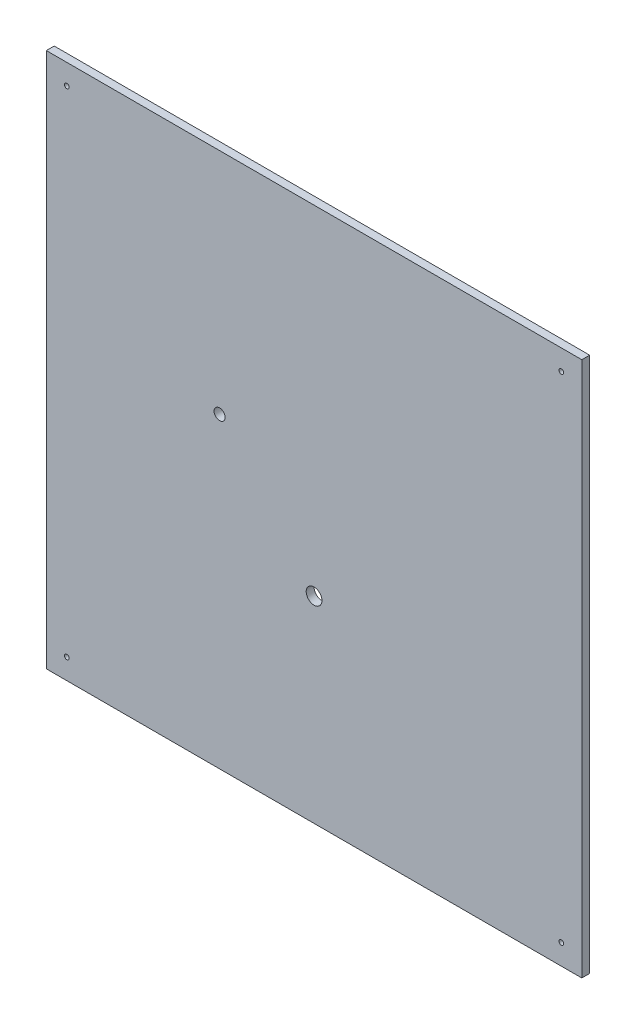
ISO-10303-21;
HEADER;
FILE_DESCRIPTION(('STEP AP214'),'2;1');
FILE_NAME('part.step','',(''),(''),'','','');
FILE_SCHEMA(('AUTOMOTIVE_DESIGN { 1 0 10303 214 1 1 1 1 }'));
ENDSEC;
DATA;
#1=APPLICATION_CONTEXT('core data for automotive mechanical design processes');
#2=APPLICATION_PROTOCOL_DEFINITION('international standard','automotive_design',2000,#1);
#3=PRODUCT_CONTEXT('',#1,'mechanical');
#4=PRODUCT('Part','Part','',(#3));
#5=PRODUCT_RELATED_PRODUCT_CATEGORY('part','',(#4));
#6=PRODUCT_DEFINITION_FORMATION('','',#4);
#7=PRODUCT_DEFINITION_CONTEXT('part definition',#1,'design');
#8=PRODUCT_DEFINITION('design','',#6,#7);
#9=PRODUCT_DEFINITION_SHAPE('','',#8);
#10=(LENGTH_UNIT() NAMED_UNIT(*) SI_UNIT(.MILLI.,.METRE.));
#11=(NAMED_UNIT(*) PLANE_ANGLE_UNIT() SI_UNIT($,.RADIAN.));
#12=(NAMED_UNIT(*) SI_UNIT($,.STERADIAN.) SOLID_ANGLE_UNIT());
#13=UNCERTAINTY_MEASURE_WITH_UNIT(LENGTH_MEASURE(1.E-05),#10,'distance_accuracy_value','');
#14=(GEOMETRIC_REPRESENTATION_CONTEXT(3) GLOBAL_UNCERTAINTY_ASSIGNED_CONTEXT((#13)) GLOBAL_UNIT_ASSIGNED_CONTEXT((#10,
#11,#12)) REPRESENTATION_CONTEXT('',''));
#15=CARTESIAN_POINT('',(0.,0.,0.));
#16=DIRECTION('',(0.,0.,1.));
#17=DIRECTION('',(1.,0.,0.));
#18=AXIS2_PLACEMENT_3D('',#15,#16,#17);
#19=CARTESIAN_POINT('',(0.,0.,5.));
#20=DIRECTION('',(0.,0.,1.));
#21=DIRECTION('',(1.,0.,0.));
#22=AXIS2_PLACEMENT_3D('',#19,#20,#21);
#23=PLANE('',#22);
#24=CARTESIAN_POINT('',(108.94719541036,-165.463974457952,5.));
#25=DIRECTION('',(0.,0.,1.));
#26=DIRECTION('',(1.,0.,0.));
#27=AXIS2_PLACEMENT_3D('',#24,#25,#26);
#28=CIRCLE('',#27,5.00000000000001);
#29=CARTESIAN_POINT('',(113.94719541036,-165.463974457952,5.));
#30=VERTEX_POINT('',#29);
#31=EDGE_CURVE('E133',#30,#30,#28,.T.);
#32=ORIENTED_EDGE('',*,*,#31,.F.);
#33=EDGE_LOOP('',(#32));
#34=FACE_BOUND('',#33,.T.);
#35=CARTESIAN_POINT('',(265.94719541036,-277.463974457952,5.));
#36=DIRECTION('',(0.,0.,1.));
#37=DIRECTION('',(1.,0.,0.));
#38=AXIS2_PLACEMENT_3D('',#35,#36,#37);
#39=CIRCLE('',#38,1.50000000000002);
#40=CARTESIAN_POINT('',(267.44719541036,-277.463974457952,5.));
#41=VERTEX_POINT('',#40);
#42=EDGE_CURVE('E121',#41,#41,#39,.T.);
#43=ORIENTED_EDGE('',*,*,#42,.F.);
#44=EDGE_LOOP('',(#43));
#45=FACE_BOUND('',#44,.T.);
#46=CARTESIAN_POINT('',(-48.0528045896396,-277.463974457952,5.));
#47=DIRECTION('',(0.,0.,1.));
#48=DIRECTION('',(1.,0.,0.));
#49=AXIS2_PLACEMENT_3D('',#46,#47,#48);
#50=CIRCLE('',#49,1.5);
#51=CARTESIAN_POINT('',(-46.5528045896396,-277.463974457952,5.));
#52=VERTEX_POINT('',#51);
#53=EDGE_CURVE('E100',#52,#52,#50,.T.);
#54=ORIENTED_EDGE('',*,*,#53,.F.);
#55=EDGE_LOOP('',(#54));
#56=FACE_BOUND('',#55,.T.);
#57=DIRECTION('',(0.,-1.,0.));
#58=VECTOR('',#57,1.);
#59=CARTESIAN_POINT('',(-61.0528045896396,49.5360255420485,5.));
#60=LINE('',#59,#58);
#61=CARTESIAN_POINT('',(-61.0528045896396,49.5360255420485,5.));
#62=VERTEX_POINT('',#61);
#63=CARTESIAN_POINT('',(-61.0528045896396,-290.463974457952,5.));
#64=VERTEX_POINT('',#63);
#65=EDGE_CURVE('E85',#62,#64,#60,.T.);
#66=ORIENTED_EDGE('',*,*,#65,.T.);
#67=DIRECTION('',(1.,0.,0.));
#68=VECTOR('',#67,1.);
#69=CARTESIAN_POINT('',(-61.0528045896396,-290.463974457952,5.));
#70=LINE('',#69,#68);
#71=CARTESIAN_POINT('',(278.94719541036,-290.463974457952,5.));
#72=VERTEX_POINT('',#71);
#73=EDGE_CURVE('E80',#64,#72,#70,.T.);
#74=ORIENTED_EDGE('',*,*,#73,.T.);
#75=DIRECTION('',(0.,1.,0.));
#76=VECTOR('',#75,1.);
#77=CARTESIAN_POINT('',(278.94719541036,49.5360255420485,5.));
#78=LINE('',#77,#76);
#79=CARTESIAN_POINT('',(278.94719541036,49.5360255420485,5.));
#80=VERTEX_POINT('',#79);
#81=EDGE_CURVE('E83',#72,#80,#78,.T.);
#82=ORIENTED_EDGE('',*,*,#81,.T.);
#83=DIRECTION('',(-1.,0.,0.));
#84=VECTOR('',#83,1.);
#85=CARTESIAN_POINT('',(-61.0528045896396,49.5360255420485,5.));
#86=LINE('',#85,#84);
#87=EDGE_CURVE('E50',#80,#62,#86,.T.);
#88=ORIENTED_EDGE('',*,*,#87,.T.);
#89=EDGE_LOOP('',(#66,#74,#82,#88));
#90=FACE_BOUND('',#89,.T.);
#91=CARTESIAN_POINT('',(-48.0528045896396,36.5360255420485,5.));
#92=DIRECTION('',(0.,0.,1.));
#93=DIRECTION('',(1.,0.,0.));
#94=AXIS2_PLACEMENT_3D('',#91,#92,#93);
#95=CIRCLE('',#94,1.5);
#96=CARTESIAN_POINT('',(-46.5528045896396,36.5360255420485,5.));
#97=VERTEX_POINT('',#96);
#98=EDGE_CURVE('E115',#97,#97,#95,.T.);
#99=ORIENTED_EDGE('',*,*,#98,.F.);
#100=EDGE_LOOP('',(#99));
#101=FACE_BOUND('',#100,.T.);
#102=CARTESIAN_POINT('',(265.94719541036,36.5360255420485,5.));
#103=DIRECTION('',(0.,0.,1.));
#104=DIRECTION('',(1.,0.,0.));
#105=AXIS2_PLACEMENT_3D('',#102,#103,#104);
#106=CIRCLE('',#105,1.50000000000002);
#107=CARTESIAN_POINT('',(267.44719541036,36.5360255420485,5.));
#108=VERTEX_POINT('',#107);
#109=EDGE_CURVE('E127',#108,#108,#106,.T.);
#110=ORIENTED_EDGE('',*,*,#109,.F.);
#111=EDGE_LOOP('',(#110));
#112=FACE_BOUND('',#111,.T.);
#113=CARTESIAN_POINT('',(48.9471954103604,-95.4639744579515,5.));
#114=DIRECTION('',(0.,0.,1.));
#115=DIRECTION('',(1.,0.,0.));
#116=AXIS2_PLACEMENT_3D('',#113,#114,#115);
#117=CIRCLE('',#116,3.5);
#118=CARTESIAN_POINT('',(52.4471954103604,-95.4639744579515,5.));
#119=VERTEX_POINT('',#118);
#120=EDGE_CURVE('E139',#119,#119,#117,.T.);
#121=ORIENTED_EDGE('',*,*,#120,.F.);
#122=EDGE_LOOP('',(#121));
#123=FACE_BOUND('',#122,.T.);
#124=ADVANCED_FACE('F33',(#34,#45,#56,#90,#101,#112,#123),#23,.T.);
#125=CARTESIAN_POINT('',(0.,0.,0.));
#126=DIRECTION('',(0.,0.,1.));
#127=DIRECTION('',(1.,0.,0.));
#128=AXIS2_PLACEMENT_3D('',#125,#126,#127);
#129=PLANE('',#128);
#130=DIRECTION('',(0.,-1.,0.));
#131=VECTOR('',#130,1.);
#132=CARTESIAN_POINT('',(-61.0528045896396,49.5360255420485,0.));
#133=LINE('',#132,#131);
#134=CARTESIAN_POINT('',(-61.0528045896396,49.5360255420485,0.));
#135=VERTEX_POINT('',#134);
#136=CARTESIAN_POINT('',(-61.0528045896396,-290.463974457952,0.));
#137=VERTEX_POINT('',#136);
#138=EDGE_CURVE('E97',#135,#137,#133,.T.);
#139=ORIENTED_EDGE('',*,*,#138,.F.);
#140=DIRECTION('',(-1.,0.,0.));
#141=VECTOR('',#140,1.);
#142=CARTESIAN_POINT('',(-61.0528045896396,49.5360255420485,0.));
#143=LINE('',#142,#141);
#144=CARTESIAN_POINT('',(278.94719541036,49.5360255420485,0.));
#145=VERTEX_POINT('',#144);
#146=EDGE_CURVE('E73',#145,#135,#143,.T.);
#147=ORIENTED_EDGE('',*,*,#146,.F.);
#148=DIRECTION('',(0.,1.,0.));
#149=VECTOR('',#148,1.);
#150=CARTESIAN_POINT('',(278.94719541036,49.5360255420485,0.));
#151=LINE('',#150,#149);
#152=CARTESIAN_POINT('',(278.94719541036,-290.463974457952,0.));
#153=VERTEX_POINT('',#152);
#154=EDGE_CURVE('E67',#153,#145,#151,.T.);
#155=ORIENTED_EDGE('',*,*,#154,.F.);
#156=DIRECTION('',(1.,0.,0.));
#157=VECTOR('',#156,1.);
#158=CARTESIAN_POINT('',(-61.0528045896396,-290.463974457952,0.));
#159=LINE('',#158,#157);
#160=EDGE_CURVE('E89',#137,#153,#159,.T.);
#161=ORIENTED_EDGE('',*,*,#160,.F.);
#162=EDGE_LOOP('',(#139,#147,#155,#161));
#163=FACE_BOUND('',#162,.T.);
#164=CARTESIAN_POINT('',(-48.0528045896396,-277.463974457952,0.));
#165=DIRECTION('',(0.,0.,1.));
#166=DIRECTION('',(1.,0.,0.));
#167=AXIS2_PLACEMENT_3D('',#164,#165,#166);
#168=CIRCLE('',#167,1.5);
#169=CARTESIAN_POINT('',(-46.5528045896396,-277.463974457952,0.));
#170=VERTEX_POINT('',#169);
#171=EDGE_CURVE('E112',#170,#170,#168,.T.);
#172=ORIENTED_EDGE('',*,*,#171,.T.);
#173=EDGE_LOOP('',(#172));
#174=FACE_BOUND('',#173,.T.);
#175=CARTESIAN_POINT('',(-48.0528045896396,36.5360255420485,0.));
#176=DIRECTION('',(0.,0.,1.));
#177=DIRECTION('',(1.,0.,0.));
#178=AXIS2_PLACEMENT_3D('',#175,#176,#177);
#179=CIRCLE('',#178,1.5);
#180=CARTESIAN_POINT('',(-46.5528045896396,36.5360255420485,0.));
#181=VERTEX_POINT('',#180);
#182=EDGE_CURVE('E118',#181,#181,#179,.T.);
#183=ORIENTED_EDGE('',*,*,#182,.T.);
#184=EDGE_LOOP('',(#183));
#185=FACE_BOUND('',#184,.T.);
#186=CARTESIAN_POINT('',(265.94719541036,-277.463974457952,0.));
#187=DIRECTION('',(0.,0.,1.));
#188=DIRECTION('',(1.,0.,0.));
#189=AXIS2_PLACEMENT_3D('',#186,#187,#188);
#190=CIRCLE('',#189,1.50000000000002);
#191=CARTESIAN_POINT('',(267.44719541036,-277.463974457952,0.));
#192=VERTEX_POINT('',#191);
#193=EDGE_CURVE('E124',#192,#192,#190,.T.);
#194=ORIENTED_EDGE('',*,*,#193,.T.);
#195=EDGE_LOOP('',(#194));
#196=FACE_BOUND('',#195,.T.);
#197=CARTESIAN_POINT('',(265.94719541036,36.5360255420485,0.));
#198=DIRECTION('',(0.,0.,1.));
#199=DIRECTION('',(1.,0.,0.));
#200=AXIS2_PLACEMENT_3D('',#197,#198,#199);
#201=CIRCLE('',#200,1.50000000000002);
#202=CARTESIAN_POINT('',(267.44719541036,36.5360255420485,0.));
#203=VERTEX_POINT('',#202);
#204=EDGE_CURVE('E130',#203,#203,#201,.T.);
#205=ORIENTED_EDGE('',*,*,#204,.T.);
#206=EDGE_LOOP('',(#205));
#207=FACE_BOUND('',#206,.T.);
#208=CARTESIAN_POINT('',(108.94719541036,-165.463974457952,0.));
#209=DIRECTION('',(0.,0.,1.));
#210=DIRECTION('',(1.,0.,0.));
#211=AXIS2_PLACEMENT_3D('',#208,#209,#210);
#212=CIRCLE('',#211,5.00000000000001);
#213=CARTESIAN_POINT('',(113.94719541036,-165.463974457952,0.));
#214=VERTEX_POINT('',#213);
#215=EDGE_CURVE('E136',#214,#214,#212,.T.);
#216=ORIENTED_EDGE('',*,*,#215,.T.);
#217=EDGE_LOOP('',(#216));
#218=FACE_BOUND('',#217,.T.);
#219=CARTESIAN_POINT('',(48.9471954103604,-95.4639744579515,0.));
#220=DIRECTION('',(0.,0.,1.));
#221=DIRECTION('',(1.,0.,0.));
#222=AXIS2_PLACEMENT_3D('',#219,#220,#221);
#223=CIRCLE('',#222,3.5);
#224=CARTESIAN_POINT('',(52.4471954103604,-95.4639744579515,0.));
#225=VERTEX_POINT('',#224);
#226=EDGE_CURVE('E142',#225,#225,#223,.T.);
#227=ORIENTED_EDGE('',*,*,#226,.T.);
#228=EDGE_LOOP('',(#227));
#229=FACE_BOUND('',#228,.T.);
#230=ADVANCED_FACE('F108',(#163,#174,#185,#196,#207,#218,#229),#129,.F.);
#231=CARTESIAN_POINT('',(-61.0528045896396,49.5360255420485,5.));
#232=DIRECTION('',(1.,0.,0.));
#233=DIRECTION('',(0.,1.,0.));
#234=AXIS2_PLACEMENT_3D('',#231,#232,#233);
#235=PLANE('',#234);
#236=ORIENTED_EDGE('',*,*,#138,.T.);
#237=DIRECTION('',(0.,0.,-1.));
#238=VECTOR('',#237,1.);
#239=CARTESIAN_POINT('',(-61.0528045896396,-290.463974457952,5.));
#240=LINE('',#239,#238);
#241=EDGE_CURVE('E11',#64,#137,#240,.T.);
#242=ORIENTED_EDGE('',*,*,#241,.F.);
#243=ORIENTED_EDGE('',*,*,#65,.F.);
#244=DIRECTION('',(0.,0.,-1.));
#245=VECTOR('',#244,1.);
#246=CARTESIAN_POINT('',(-61.0528045896396,49.5360255420485,5.));
#247=LINE('',#246,#245);
#248=EDGE_CURVE('E93',#62,#135,#247,.T.);
#249=ORIENTED_EDGE('',*,*,#248,.T.);
#250=EDGE_LOOP('',(#236,#242,#243,#249));
#251=FACE_BOUND('',#250,.T.);
#252=ADVANCED_FACE('F35',(#251),#235,.F.);
#253=CARTESIAN_POINT('',(-61.0528045896396,-290.463974457952,5.));
#254=DIRECTION('',(0.,1.,0.));
#255=DIRECTION('',(0.,0.,1.));
#256=AXIS2_PLACEMENT_3D('',#253,#254,#255);
#257=PLANE('',#256);
#258=ORIENTED_EDGE('',*,*,#160,.T.);
#259=DIRECTION('',(0.,0.,-1.));
#260=VECTOR('',#259,1.);
#261=CARTESIAN_POINT('',(278.94719541036,-290.463974457952,5.));
#262=LINE('',#261,#260);
#263=EDGE_CURVE('E42',#72,#153,#262,.T.);
#264=ORIENTED_EDGE('',*,*,#263,.F.);
#265=ORIENTED_EDGE('',*,*,#73,.F.);
#266=ORIENTED_EDGE('',*,*,#241,.T.);
#267=EDGE_LOOP('',(#258,#264,#265,#266));
#268=FACE_BOUND('',#267,.T.);
#269=ADVANCED_FACE('F88',(#268),#257,.F.);
#270=CARTESIAN_POINT('',(278.94719541036,49.5360255420485,5.));
#271=DIRECTION('',(-1.,0.,0.));
#272=DIRECTION('',(0.,-1.,0.));
#273=AXIS2_PLACEMENT_3D('',#270,#271,#272);
#274=PLANE('',#273);
#275=ORIENTED_EDGE('',*,*,#154,.T.);
#276=DIRECTION('',(0.,0.,-1.));
#277=VECTOR('',#276,1.);
#278=CARTESIAN_POINT('',(278.94719541036,49.5360255420485,5.));
#279=LINE('',#278,#277);
#280=EDGE_CURVE('E90',#80,#145,#279,.T.);
#281=ORIENTED_EDGE('',*,*,#280,.F.);
#282=ORIENTED_EDGE('',*,*,#81,.F.);
#283=ORIENTED_EDGE('',*,*,#263,.T.);
#284=EDGE_LOOP('',(#275,#281,#282,#283));
#285=FACE_BOUND('',#284,.T.);
#286=ADVANCED_FACE('F91',(#285),#274,.F.);
#287=CARTESIAN_POINT('',(-61.0528045896396,49.5360255420485,5.));
#288=DIRECTION('',(0.,-1.,0.));
#289=DIRECTION('',(0.,0.,-1.));
#290=AXIS2_PLACEMENT_3D('',#287,#288,#289);
#291=PLANE('',#290);
#292=ORIENTED_EDGE('',*,*,#146,.T.);
#293=ORIENTED_EDGE('',*,*,#248,.F.);
#294=ORIENTED_EDGE('',*,*,#87,.F.);
#295=ORIENTED_EDGE('',*,*,#280,.T.);
#296=EDGE_LOOP('',(#292,#293,#294,#295));
#297=FACE_BOUND('',#296,.T.);
#298=ADVANCED_FACE('F105',(#297),#291,.F.);
#299=CARTESIAN_POINT('',(-48.0528045896396,-277.463974457952,5.));
#300=DIRECTION('',(0.,0.,-1.));
#301=DIRECTION('',(-1.,0.,0.));
#302=AXIS2_PLACEMENT_3D('',#299,#300,#301);
#303=CYLINDRICAL_SURFACE('',#302,1.5);
#304=ORIENTED_EDGE('',*,*,#53,.T.);
#305=EDGE_LOOP('',(#304));
#306=FACE_BOUND('',#305,.T.);
#307=ORIENTED_EDGE('',*,*,#171,.F.);
#308=EDGE_LOOP('',(#307));
#309=FACE_BOUND('',#308,.T.);
#310=ADVANCED_FACE('F161',(#306,#309),#303,.F.);
#311=CARTESIAN_POINT('',(-48.0528045896396,36.5360255420485,5.));
#312=DIRECTION('',(0.,0.,-1.));
#313=DIRECTION('',(-1.,0.,0.));
#314=AXIS2_PLACEMENT_3D('',#311,#312,#313);
#315=CYLINDRICAL_SURFACE('',#314,1.5);
#316=ORIENTED_EDGE('',*,*,#98,.T.);
#317=EDGE_LOOP('',(#316));
#318=FACE_BOUND('',#317,.T.);
#319=ORIENTED_EDGE('',*,*,#182,.F.);
#320=EDGE_LOOP('',(#319));
#321=FACE_BOUND('',#320,.T.);
#322=ADVANCED_FACE('F207',(#318,#321),#315,.F.);
#323=CARTESIAN_POINT('',(265.94719541036,-277.463974457952,5.));
#324=DIRECTION('',(0.,0.,-1.));
#325=DIRECTION('',(-1.,0.,0.));
#326=AXIS2_PLACEMENT_3D('',#323,#324,#325);
#327=CYLINDRICAL_SURFACE('',#326,1.50000000000002);
#328=ORIENTED_EDGE('',*,*,#42,.T.);
#329=EDGE_LOOP('',(#328));
#330=FACE_BOUND('',#329,.T.);
#331=ORIENTED_EDGE('',*,*,#193,.F.);
#332=EDGE_LOOP('',(#331));
#333=FACE_BOUND('',#332,.T.);
#334=ADVANCED_FACE('F215',(#330,#333),#327,.F.);
#335=CARTESIAN_POINT('',(265.94719541036,36.5360255420485,5.));
#336=DIRECTION('',(0.,0.,-1.));
#337=DIRECTION('',(-1.,0.,0.));
#338=AXIS2_PLACEMENT_3D('',#335,#336,#337);
#339=CYLINDRICAL_SURFACE('',#338,1.50000000000002);
#340=ORIENTED_EDGE('',*,*,#109,.T.);
#341=EDGE_LOOP('',(#340));
#342=FACE_BOUND('',#341,.T.);
#343=ORIENTED_EDGE('',*,*,#204,.F.);
#344=EDGE_LOOP('',(#343));
#345=FACE_BOUND('',#344,.T.);
#346=ADVANCED_FACE('F223',(#342,#345),#339,.F.);
#347=CARTESIAN_POINT('',(108.94719541036,-165.463974457952,5.));
#348=DIRECTION('',(0.,0.,-1.));
#349=DIRECTION('',(-1.,0.,0.));
#350=AXIS2_PLACEMENT_3D('',#347,#348,#349);
#351=CYLINDRICAL_SURFACE('',#350,5.00000000000001);
#352=ORIENTED_EDGE('',*,*,#31,.T.);
#353=EDGE_LOOP('',(#352));
#354=FACE_BOUND('',#353,.T.);
#355=ORIENTED_EDGE('',*,*,#215,.F.);
#356=EDGE_LOOP('',(#355));
#357=FACE_BOUND('',#356,.T.);
#358=ADVANCED_FACE('F232',(#354,#357),#351,.F.);
#359=CARTESIAN_POINT('',(48.9471954103604,-95.4639744579515,5.));
#360=DIRECTION('',(0.,0.,-1.));
#361=DIRECTION('',(-1.,0.,0.));
#362=AXIS2_PLACEMENT_3D('',#359,#360,#361);
#363=CYLINDRICAL_SURFACE('',#362,3.5);
#364=ORIENTED_EDGE('',*,*,#120,.T.);
#365=EDGE_LOOP('',(#364));
#366=FACE_BOUND('',#365,.T.);
#367=ORIENTED_EDGE('',*,*,#226,.F.);
#368=EDGE_LOOP('',(#367));
#369=FACE_BOUND('',#368,.T.);
#370=ADVANCED_FACE('F148',(#366,#369),#363,.F.);
#371=CLOSED_SHELL('',(#124,#230,#252,#269,#286,#298,#310,#322,#334,#346,#358,#370));
#372=MANIFOLD_SOLID_BREP('B2',#371);
#373=ADVANCED_BREP_SHAPE_REPRESENTATION('',(#18,#372),#14);
#374=SHAPE_DEFINITION_REPRESENTATION(#9,#373);
ENDSEC;
END-ISO-10303-21;
